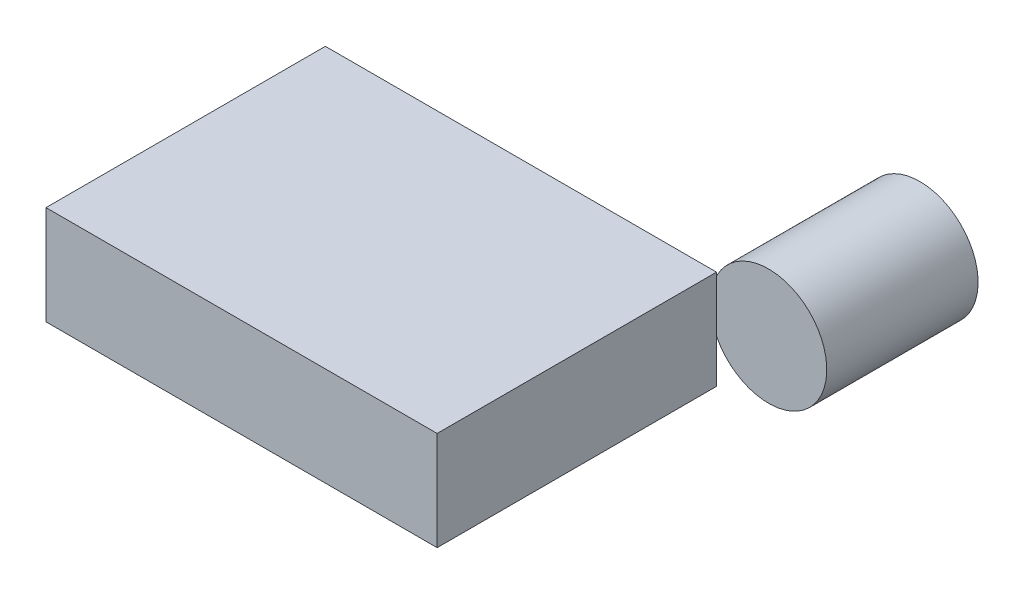
ISO-10303-21;
HEADER;
FILE_DESCRIPTION(('STEP AP214'),'2;1');
FILE_NAME('part.step','',(''),(''),'','','');
FILE_SCHEMA(('AUTOMOTIVE_DESIGN { 1 0 10303 214 1 1 1 1 }'));
ENDSEC;
DATA;
#1=APPLICATION_CONTEXT('core data for automotive mechanical design processes');
#2=APPLICATION_PROTOCOL_DEFINITION('international standard','automotive_design',2000,#1);
#3=PRODUCT_CONTEXT('',#1,'mechanical');
#4=PRODUCT('Part','Part','',(#3));
#5=PRODUCT_RELATED_PRODUCT_CATEGORY('part','',(#4));
#6=PRODUCT_DEFINITION_FORMATION('','',#4);
#7=PRODUCT_DEFINITION_CONTEXT('part definition',#1,'design');
#8=PRODUCT_DEFINITION('design','',#6,#7);
#9=PRODUCT_DEFINITION_SHAPE('','',#8);
#10=(LENGTH_UNIT() NAMED_UNIT(*) SI_UNIT(.MILLI.,.METRE.));
#11=(NAMED_UNIT(*) PLANE_ANGLE_UNIT() SI_UNIT($,.RADIAN.));
#12=(NAMED_UNIT(*) SI_UNIT($,.STERADIAN.) SOLID_ANGLE_UNIT());
#13=UNCERTAINTY_MEASURE_WITH_UNIT(LENGTH_MEASURE(1.E-05),#10,'distance_accuracy_value','');
#14=(GEOMETRIC_REPRESENTATION_CONTEXT(3) GLOBAL_UNCERTAINTY_ASSIGNED_CONTEXT((#13)) GLOBAL_UNIT_ASSIGNED_CONTEXT((#10,
#11,#12)) REPRESENTATION_CONTEXT('',''));
#15=CARTESIAN_POINT('',(0.,0.,0.));
#16=DIRECTION('',(0.,0.,1.));
#17=DIRECTION('',(1.,0.,0.));
#18=AXIS2_PLACEMENT_3D('',#15,#16,#17);
#19=CARTESIAN_POINT('',(21.2710913846715,5.97526617280861,-25.));
#20=DIRECTION('',(0.,0.,1.));
#21=DIRECTION('',(1.,0.,0.));
#22=AXIS2_PLACEMENT_3D('',#19,#20,#21);
#23=CYLINDRICAL_SURFACE('',#22,5.);
#24=CARTESIAN_POINT('',(21.2710913846715,5.97526617280861,-25.));
#25=DIRECTION('',(0.,0.,-1.));
#26=DIRECTION('',(-1.,0.,0.));
#27=AXIS2_PLACEMENT_3D('',#24,#25,#26);
#28=CIRCLE('',#27,5.);
#29=CARTESIAN_POINT('',(16.2710913846715,5.97526617280861,-25.));
#30=VERTEX_POINT('',#29);
#31=EDGE_CURVE('E11',#30,#30,#28,.T.);
#32=ORIENTED_EDGE('',*,*,#31,.F.);
#33=EDGE_LOOP('',(#32));
#34=FACE_BOUND('',#33,.T.);
#35=CARTESIAN_POINT('',(21.2710913846715,5.97526617280861,-12.));
#36=DIRECTION('',(0.,0.,-1.));
#37=DIRECTION('',(-1.,0.,0.));
#38=AXIS2_PLACEMENT_3D('',#35,#36,#37);
#39=CIRCLE('',#38,5.);
#40=CARTESIAN_POINT('',(16.2710913846715,5.97526617280861,-12.));
#41=VERTEX_POINT('',#40);
#42=EDGE_CURVE('E44',#41,#41,#39,.T.);
#43=ORIENTED_EDGE('',*,*,#42,.T.);
#44=EDGE_LOOP('',(#43));
#45=FACE_BOUND('',#44,.T.);
#46=ADVANCED_FACE('F41',(#34,#45),#23,.T.);
#47=CARTESIAN_POINT('',(21.2710913846715,5.97526617280861,-25.));
#48=DIRECTION('',(0.,0.,-1.));
#49=DIRECTION('',(-1.,0.,0.));
#50=AXIS2_PLACEMENT_3D('',#47,#48,#49);
#51=PLANE('',#50);
#52=ORIENTED_EDGE('',*,*,#31,.T.);
#53=EDGE_LOOP('',(#52));
#54=FACE_BOUND('',#53,.T.);
#55=ADVANCED_FACE('F56',(#54),#51,.T.);
#56=CARTESIAN_POINT('',(21.2710913846715,5.97526617280861,-12.));
#57=DIRECTION('',(0.,0.,-1.));
#58=DIRECTION('',(-1.,0.,0.));
#59=AXIS2_PLACEMENT_3D('',#56,#57,#58);
#60=PLANE('',#59);
#61=ORIENTED_EDGE('',*,*,#42,.F.);
#62=EDGE_LOOP('',(#61));
#63=FACE_BOUND('',#62,.T.);
#64=ADVANCED_FACE('F54',(#63),#60,.F.);
#65=CLOSED_SHELL('',(#46,#55,#64));
#66=MANIFOLD_SOLID_BREP('B2',#65);
#67=CARTESIAN_POINT('',(16.8,8.5,12.));
#68=DIRECTION('',(-1.,0.,0.));
#69=DIRECTION('',(0.,0.,1.));
#70=AXIS2_PLACEMENT_3D('',#67,#68,#69);
#71=PLANE('',#70);
#72=DIRECTION('',(0.,0.,-1.));
#73=VECTOR('',#72,1.);
#74=CARTESIAN_POINT('',(16.8,0.,12.));
#75=LINE('',#74,#73);
#76=CARTESIAN_POINT('',(16.8,0.,12.));
#77=VERTEX_POINT('',#76);
#78=CARTESIAN_POINT('',(16.8,0.,-12.));
#79=VERTEX_POINT('',#78);
#80=EDGE_CURVE('E145',#77,#79,#75,.T.);
#81=ORIENTED_EDGE('',*,*,#80,.T.);
#82=DIRECTION('',(0.,-1.,0.));
#83=VECTOR('',#82,1.);
#84=CARTESIAN_POINT('',(16.8,8.5,-12.));
#85=LINE('',#84,#83);
#86=CARTESIAN_POINT('',(16.8,8.5,-12.));
#87=VERTEX_POINT('',#86);
#88=EDGE_CURVE('E39',#87,#79,#85,.T.);
#89=ORIENTED_EDGE('',*,*,#88,.F.);
#90=DIRECTION('',(0.,0.,-1.));
#91=VECTOR('',#90,1.);
#92=CARTESIAN_POINT('',(16.8,8.5,12.));
#93=LINE('',#92,#91);
#94=CARTESIAN_POINT('',(16.8,8.5,12.));
#95=VERTEX_POINT('',#94);
#96=EDGE_CURVE('E133',#95,#87,#93,.T.);
#97=ORIENTED_EDGE('',*,*,#96,.F.);
#98=DIRECTION('',(0.,-1.,0.));
#99=VECTOR('',#98,1.);
#100=CARTESIAN_POINT('',(16.8,8.5,12.));
#101=LINE('',#100,#99);
#102=EDGE_CURVE('E141',#95,#77,#101,.T.);
#103=ORIENTED_EDGE('',*,*,#102,.T.);
#104=EDGE_LOOP('',(#81,#89,#97,#103));
#105=FACE_BOUND('',#104,.T.);
#106=ADVANCED_FACE('F82',(#105),#71,.F.);
#107=CARTESIAN_POINT('',(-16.8,8.5,-12.));
#108=DIRECTION('',(0.,0.,1.));
#109=DIRECTION('',(1.,0.,0.));
#110=AXIS2_PLACEMENT_3D('',#107,#108,#109);
#111=PLANE('',#110);
#112=DIRECTION('',(-1.,0.,0.));
#113=VECTOR('',#112,1.);
#114=CARTESIAN_POINT('',(-16.8,0.,-12.));
#115=LINE('',#114,#113);
#116=CARTESIAN_POINT('',(-16.8,0.,-12.));
#117=VERTEX_POINT('',#116);
#118=EDGE_CURVE('E137',#79,#117,#115,.T.);
#119=ORIENTED_EDGE('',*,*,#118,.T.);
#120=DIRECTION('',(0.,-1.,0.));
#121=VECTOR('',#120,1.);
#122=CARTESIAN_POINT('',(-16.8,8.5,-12.));
#123=LINE('',#122,#121);
#124=CARTESIAN_POINT('',(-16.8,8.5,-12.));
#125=VERTEX_POINT('',#124);
#126=EDGE_CURVE('E90',#125,#117,#123,.T.);
#127=ORIENTED_EDGE('',*,*,#126,.F.);
#128=DIRECTION('',(-1.,0.,0.));
#129=VECTOR('',#128,1.);
#130=CARTESIAN_POINT('',(-16.8,8.5,-12.));
#131=LINE('',#130,#129);
#132=EDGE_CURVE('E128',#87,#125,#131,.T.);
#133=ORIENTED_EDGE('',*,*,#132,.F.);
#134=ORIENTED_EDGE('',*,*,#88,.T.);
#135=EDGE_LOOP('',(#119,#127,#133,#134));
#136=FACE_BOUND('',#135,.T.);
#137=ADVANCED_FACE('F136',(#136),#111,.F.);
#138=CARTESIAN_POINT('',(-16.8,8.5,12.));
#139=DIRECTION('',(1.,0.,0.));
#140=DIRECTION('',(0.,0.,-1.));
#141=AXIS2_PLACEMENT_3D('',#138,#139,#140);
#142=PLANE('',#141);
#143=DIRECTION('',(0.,0.,1.));
#144=VECTOR('',#143,1.);
#145=CARTESIAN_POINT('',(-16.8,0.,12.));
#146=LINE('',#145,#144);
#147=CARTESIAN_POINT('',(-16.8,0.,12.));
#148=VERTEX_POINT('',#147);
#149=EDGE_CURVE('E115',#117,#148,#146,.T.);
#150=ORIENTED_EDGE('',*,*,#149,.T.);
#151=DIRECTION('',(0.,-1.,0.));
#152=VECTOR('',#151,1.);
#153=CARTESIAN_POINT('',(-16.8,8.5,12.));
#154=LINE('',#153,#152);
#155=CARTESIAN_POINT('',(-16.8,8.5,12.));
#156=VERTEX_POINT('',#155);
#157=EDGE_CURVE('E138',#156,#148,#154,.T.);
#158=ORIENTED_EDGE('',*,*,#157,.F.);
#159=DIRECTION('',(0.,0.,1.));
#160=VECTOR('',#159,1.);
#161=CARTESIAN_POINT('',(-16.8,8.5,12.));
#162=LINE('',#161,#160);
#163=EDGE_CURVE('E131',#125,#156,#162,.T.);
#164=ORIENTED_EDGE('',*,*,#163,.F.);
#165=ORIENTED_EDGE('',*,*,#126,.T.);
#166=EDGE_LOOP('',(#150,#158,#164,#165));
#167=FACE_BOUND('',#166,.T.);
#168=ADVANCED_FACE('F139',(#167),#142,.F.);
#169=CARTESIAN_POINT('',(-16.8,8.5,12.));
#170=DIRECTION('',(0.,0.,-1.));
#171=DIRECTION('',(-1.,0.,0.));
#172=AXIS2_PLACEMENT_3D('',#169,#170,#171);
#173=PLANE('',#172);
#174=DIRECTION('',(1.,0.,0.));
#175=VECTOR('',#174,1.);
#176=CARTESIAN_POINT('',(-16.8,0.,12.));
#177=LINE('',#176,#175);
#178=EDGE_CURVE('E121',#148,#77,#177,.T.);
#179=ORIENTED_EDGE('',*,*,#178,.T.);
#180=ORIENTED_EDGE('',*,*,#102,.F.);
#181=DIRECTION('',(1.,0.,0.));
#182=VECTOR('',#181,1.);
#183=CARTESIAN_POINT('',(-16.8,8.5,12.));
#184=LINE('',#183,#182);
#185=EDGE_CURVE('E98',#156,#95,#184,.T.);
#186=ORIENTED_EDGE('',*,*,#185,.F.);
#187=ORIENTED_EDGE('',*,*,#157,.T.);
#188=EDGE_LOOP('',(#179,#180,#186,#187));
#189=FACE_BOUND('',#188,.T.);
#190=ADVANCED_FACE('F152',(#189),#173,.F.);
#191=CARTESIAN_POINT('',(0.,8.5,0.));
#192=DIRECTION('',(0.,-1.,0.));
#193=DIRECTION('',(0.,0.,-1.));
#194=AXIS2_PLACEMENT_3D('',#191,#192,#193);
#195=PLANE('',#194);
#196=ORIENTED_EDGE('',*,*,#96,.T.);
#197=ORIENTED_EDGE('',*,*,#132,.T.);
#198=ORIENTED_EDGE('',*,*,#163,.T.);
#199=ORIENTED_EDGE('',*,*,#185,.T.);
#200=EDGE_LOOP('',(#196,#197,#198,#199));
#201=FACE_BOUND('',#200,.T.);
#202=ADVANCED_FACE('F129',(#201),#195,.F.);
#203=CARTESIAN_POINT('',(0.,0.,0.));
#204=DIRECTION('',(0.,-1.,0.));
#205=DIRECTION('',(0.,0.,-1.));
#206=AXIS2_PLACEMENT_3D('',#203,#204,#205);
#207=PLANE('',#206);
#208=ORIENTED_EDGE('',*,*,#80,.F.);
#209=ORIENTED_EDGE('',*,*,#178,.F.);
#210=ORIENTED_EDGE('',*,*,#149,.F.);
#211=ORIENTED_EDGE('',*,*,#118,.F.);
#212=EDGE_LOOP('',(#208,#209,#210,#211));
#213=FACE_BOUND('',#212,.T.);
#214=ADVANCED_FACE('F155',(#213),#207,.T.);
#215=CLOSED_SHELL('',(#106,#137,#168,#190,#202,#214));
#216=MANIFOLD_SOLID_BREP('B6',#215);
#217=ADVANCED_BREP_SHAPE_REPRESENTATION('',(#18,#66,#216),#14);
#218=SHAPE_DEFINITION_REPRESENTATION(#9,#217);
ENDSEC;
END-ISO-10303-21;
